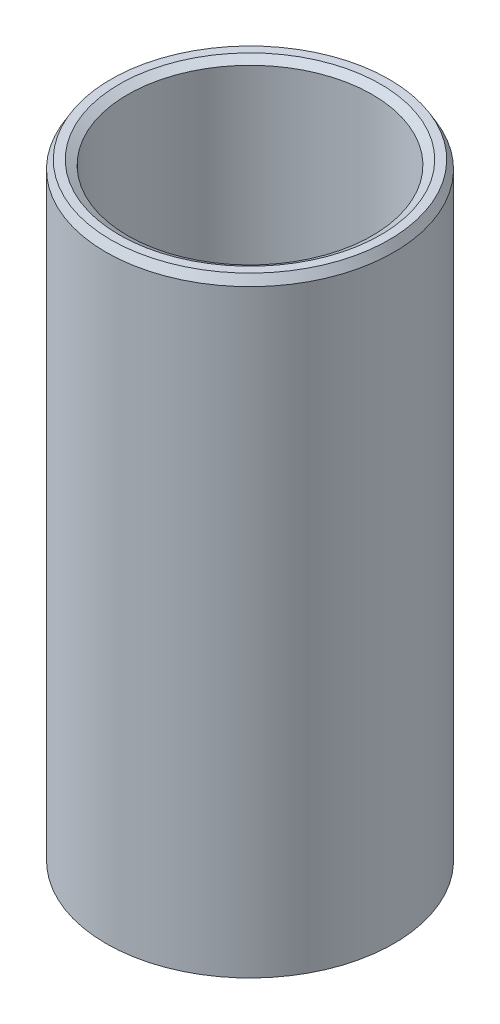
ISO-10303-21;
HEADER;
FILE_DESCRIPTION(('STEP AP214'),'2;1');
FILE_NAME('part.step','',(''),(''),'','','');
FILE_SCHEMA(('AUTOMOTIVE_DESIGN { 1 0 10303 214 1 1 1 1 }'));
ENDSEC;
DATA;
#1=APPLICATION_CONTEXT('core data for automotive mechanical design processes');
#2=APPLICATION_PROTOCOL_DEFINITION('international standard','automotive_design',2000,#1);
#3=PRODUCT_CONTEXT('',#1,'mechanical');
#4=PRODUCT('Part','Part','',(#3));
#5=PRODUCT_RELATED_PRODUCT_CATEGORY('part','',(#4));
#6=PRODUCT_DEFINITION_FORMATION('','',#4);
#7=PRODUCT_DEFINITION_CONTEXT('part definition',#1,'design');
#8=PRODUCT_DEFINITION('design','',#6,#7);
#9=PRODUCT_DEFINITION_SHAPE('','',#8);
#10=(LENGTH_UNIT() NAMED_UNIT(*) SI_UNIT(.MILLI.,.METRE.));
#11=(NAMED_UNIT(*) PLANE_ANGLE_UNIT() SI_UNIT($,.RADIAN.));
#12=(NAMED_UNIT(*) SI_UNIT($,.STERADIAN.) SOLID_ANGLE_UNIT());
#13=UNCERTAINTY_MEASURE_WITH_UNIT(LENGTH_MEASURE(1.E-05),#10,'distance_accuracy_value','');
#14=(GEOMETRIC_REPRESENTATION_CONTEXT(3) GLOBAL_UNCERTAINTY_ASSIGNED_CONTEXT((#13)) GLOBAL_UNIT_ASSIGNED_CONTEXT((#10,
#11,#12)) REPRESENTATION_CONTEXT('',''));
#15=CARTESIAN_POINT('',(0.,0.,0.));
#16=DIRECTION('',(0.,0.,1.));
#17=DIRECTION('',(1.,0.,0.));
#18=AXIS2_PLACEMENT_3D('',#15,#16,#17);
#19=CARTESIAN_POINT('',(0.,233.828254303546,0.));
#20=DIRECTION('',(0.,-1.,0.));
#21=DIRECTION('',(0.,0.,-1.));
#22=AXIS2_PLACEMENT_3D('',#19,#20,#21);
#23=CYLINDRICAL_SURFACE('',#22,55.);
#24=CARTESIAN_POINT('',(0.,1.84201096185144,0.));
#25=DIRECTION('',(0.,1.,0.));
#26=DIRECTION('',(0.,0.,1.));
#27=AXIS2_PLACEMENT_3D('',#24,#25,#26);
#28=CIRCLE('',#27,55.);
#29=CARTESIAN_POINT('',(0.,1.84201096185141,-55.));
#30=VERTEX_POINT('',#29);
#31=EDGE_CURVE('E10',#30,#30,#28,.T.);
#32=CARTESIAN_POINT('',(0.,230.637797729521,0.));
#33=DIRECTION('',(0.,1.,0.));
#34=DIRECTION('',(0.,0.,1.));
#35=AXIS2_PLACEMENT_3D('',#32,#33,#34);
#36=CIRCLE('',#35,55.);
#37=CARTESIAN_POINT('',(0.,230.637797729521,-55.));
#38=VERTEX_POINT('',#37);
#39=EDGE_CURVE('E50',#38,#38,#36,.F.);
#40=CARTESIAN_POINT('',(0.,1.84201096185141,-55.));
#41=CARTESIAN_POINT('',(0.,4.22530040734797,-55.));
#42=CARTESIAN_POINT('',(0.,6.60858985284453,-55.));
#43=CARTESIAN_POINT('',(0.,11.3751687438376,-55.));
#44=CARTESIAN_POINT('',(0.,13.7584581893342,-55.));
#45=CARTESIAN_POINT('',(0.,18.5250370803273,-55.));
#46=CARTESIAN_POINT('',(0.,20.9083265258239,-55.));
#47=CARTESIAN_POINT('',(0.,25.674905416817,-55.));
#48=CARTESIAN_POINT('',(0.,28.0581948623135,-55.));
#49=CARTESIAN_POINT('',(0.,32.8247737533066,-55.));
#50=CARTESIAN_POINT('',(0.,35.2080631988032,-55.));
#51=CARTESIAN_POINT('',(0.,39.9746420897963,-55.));
#52=CARTESIAN_POINT('',(0.,42.3579315352929,-55.));
#53=CARTESIAN_POINT('',(0.,47.124510426286,-55.));
#54=CARTESIAN_POINT('',(0.,49.5077998717825,-55.));
#55=CARTESIAN_POINT('',(0.,54.2743787627756,-55.));
#56=CARTESIAN_POINT('',(0.,56.6576682082722,-55.));
#57=CARTESIAN_POINT('',(0.,61.4242470992653,-55.));
#58=CARTESIAN_POINT('',(0.,63.8075365447619,-55.));
#59=CARTESIAN_POINT('',(0.,68.574115435755,-55.));
#60=CARTESIAN_POINT('',(0.,70.9574048812515,-55.));
#61=CARTESIAN_POINT('',(0.,75.7239837722446,-55.));
#62=CARTESIAN_POINT('',(0.,78.1072732177412,-55.));
#63=CARTESIAN_POINT('',(0.,82.8738521087343,-55.));
#64=CARTESIAN_POINT('',(0.,85.2571415542309,-55.));
#65=CARTESIAN_POINT('',(0.,90.023720445224,-55.));
#66=CARTESIAN_POINT('',(0.,92.4070098907205,-55.));
#67=CARTESIAN_POINT('',(0.,97.1735887817137,-55.));
#68=CARTESIAN_POINT('',(0.,99.5568782272102,-55.));
#69=CARTESIAN_POINT('',(0.,104.323457118203,-55.));
#70=CARTESIAN_POINT('',(0.,106.7067465637,-55.));
#71=CARTESIAN_POINT('',(0.,111.473325454693,-55.));
#72=CARTESIAN_POINT('',(0.,113.85661490019,-55.));
#73=CARTESIAN_POINT('',(0.,118.623193791183,-55.));
#74=CARTESIAN_POINT('',(0.,121.006483236679,-55.));
#75=CARTESIAN_POINT('',(0.,125.773062127672,-55.));
#76=CARTESIAN_POINT('',(0.,128.156351573169,-55.));
#77=CARTESIAN_POINT('',(0.,132.922930464162,-55.));
#78=CARTESIAN_POINT('',(0.,135.306219909659,-55.));
#79=CARTESIAN_POINT('',(0.,140.072798800652,-55.));
#80=CARTESIAN_POINT('',(0.,142.456088246148,-55.));
#81=CARTESIAN_POINT('',(0.,147.222667137141,-55.));
#82=CARTESIAN_POINT('',(0.,149.605956582638,-55.));
#83=CARTESIAN_POINT('',(0.,154.372535473631,-55.));
#84=CARTESIAN_POINT('',(0.,156.755824919128,-55.));
#85=CARTESIAN_POINT('',(0.,161.522403810121,-55.));
#86=CARTESIAN_POINT('',(0.,163.905693255617,-55.));
#87=CARTESIAN_POINT('',(0.,168.67227214661,-55.));
#88=CARTESIAN_POINT('',(0.,171.055561592107,-55.));
#89=CARTESIAN_POINT('',(0.,175.8221404831,-55.));
#90=CARTESIAN_POINT('',(0.,178.205429928597,-55.));
#91=CARTESIAN_POINT('',(0.,182.97200881959,-55.));
#92=CARTESIAN_POINT('',(0.,185.355298265086,-55.));
#93=CARTESIAN_POINT('',(0.,190.121877156079,-55.));
#94=CARTESIAN_POINT('',(0.,192.505166601576,-55.));
#95=CARTESIAN_POINT('',(0.,197.271745492569,-55.));
#96=CARTESIAN_POINT('',(0.,199.655034938066,-55.));
#97=CARTESIAN_POINT('',(0.,204.421613829059,-55.));
#98=CARTESIAN_POINT('',(0.,206.804903274555,-55.));
#99=CARTESIAN_POINT('',(0.,211.571482165548,-55.));
#100=CARTESIAN_POINT('',(0.,213.954771611045,-55.));
#101=CARTESIAN_POINT('',(0.,218.721350502038,-55.));
#102=CARTESIAN_POINT('',(0.,221.104639947535,-55.));
#103=CARTESIAN_POINT('',(0.,225.871218838528,-55.));
#104=CARTESIAN_POINT('',(0.,228.254508284024,-55.));
#105=CARTESIAN_POINT('',(0.,230.637797729521,-55.));
#106=B_SPLINE_CURVE_WITH_KNOTS('',3,(#40,#41,#42,#43,#44,#45,#46,#47,#48,#49,#50,#51,#52,#53,
#54,#55,#56,#57,#58,#59,#60,#61,#62,#63,#64,#65,#66,#67,#68,#69,#70,#71,#72,#73,#74,#75,#76,#77,
#78,#79,#80,#81,#82,#83,#84,#85,#86,#87,#88,#89,#90,#91,#92,#93,#94,#95,#96,#97,#98,#99,#100,
#101,#102,#103,#104,#105),.UNSPECIFIED.,.F.,.F.,(4,2,2,2,2,2,2,2,2,2,2,2,2,2,2,2,2,2,2,2,2,2,2,
2,2,2,2,2,2,2,2,2,4),(0.,7.14986833648967,14.2997366729793,21.449605009469,28.5994733459587,
35.7493416824483,42.899210018938,50.0490783554277,57.1989466919173,64.348815028407,
71.4986833648967,78.6485517013864,85.798420037876,92.9482883743657,100.098156710855,
107.248025047345,114.397893383835,121.547761720324,128.697630056814,135.847498393304,
142.997366729793,150.147235066283,157.297103402773,164.446971739262,171.596840075752,
178.746708412242,185.896576748731,193.046445085221,200.196313421711,207.3461817582,
214.49605009469,221.64591843118,228.795786767669),.UNSPECIFIED.);
#107=EDGE_CURVE('BSEAM39',#30,#38,#106,.T.);
#108=ORIENTED_EDGE('',*,*,#31,.T.);
#109=ORIENTED_EDGE('',*,*,#39,.T.);
#110=ORIENTED_EDGE('',*,*,#107,.T.);
#111=ORIENTED_EDGE('',*,*,#107,.F.);
#112=EDGE_LOOP('',(#108,#110,#109,#111));
#113=FACE_BOUND('',#112,.T.);
#114=ADVANCED_FACE('F39',(#113),#23,.T.);
#115=CARTESIAN_POINT('',(0.,233.828254303546,0.));
#116=DIRECTION('',(0.,1.,0.));
#117=DIRECTION('',(0.,0.,1.));
#118=AXIS2_PLACEMENT_3D('',#115,#116,#117);
#119=PLANE('',#118);
#120=CARTESIAN_POINT('',(0.,233.828254303546,0.));
#121=DIRECTION('',(0.,1.,0.));
#122=DIRECTION('',(0.,0.,1.));
#123=AXIS2_PLACEMENT_3D('',#120,#121,#122);
#124=CIRCLE('',#123,49.9234246095822);
#125=CARTESIAN_POINT('',(0.,233.828254303546,49.9234246095822));
#126=VERTEX_POINT('',#125);
#127=EDGE_CURVE('E58',#126,#126,#124,.F.);
#128=ORIENTED_EDGE('',*,*,#127,.T.);
#129=EDGE_LOOP('',(#128));
#130=FACE_BOUND('',#129,.T.);
#131=CARTESIAN_POINT('',(0.,233.828254303546,0.));
#132=DIRECTION('',(0.,1.,0.));
#133=DIRECTION('',(0.,0.,1.));
#134=AXIS2_PLACEMENT_3D('',#131,#132,#133);
#135=CIRCLE('',#134,53.1579890381487);
#136=CARTESIAN_POINT('',(0.,233.828254303546,53.1579890381487));
#137=VERTEX_POINT('',#136);
#138=EDGE_CURVE('E61',#137,#137,#135,.T.);
#139=ORIENTED_EDGE('',*,*,#138,.T.);
#140=EDGE_LOOP('',(#139));
#141=FACE_BOUND('',#140,.T.);
#142=ADVANCED_FACE('F88',(#130,#141),#119,.T.);
#143=CARTESIAN_POINT('',(0.,0.,0.));
#144=DIRECTION('',(0.,1.,0.));
#145=DIRECTION('',(0.,0.,1.));
#146=AXIS2_PLACEMENT_3D('',#143,#144,#145);
#147=PLANE('',#146);
#148=CARTESIAN_POINT('',(0.,0.,0.));
#149=DIRECTION('',(0.,1.,0.));
#150=DIRECTION('',(0.,0.,1.));
#151=AXIS2_PLACEMENT_3D('',#148,#149,#150);
#152=CIRCLE('',#151,48.5749789974081);
#153=CARTESIAN_POINT('',(0.,0.,48.5749789974081));
#154=VERTEX_POINT('',#153);
#155=EDGE_CURVE('E51',#154,#154,#152,.T.);
#156=ORIENTED_EDGE('',*,*,#155,.T.);
#157=EDGE_LOOP('',(#156));
#158=FACE_BOUND('',#157,.T.);
#159=CARTESIAN_POINT('',(0.,0.,0.));
#160=DIRECTION('',(0.,1.,0.));
#161=DIRECTION('',(0.,0.,1.));
#162=AXIS2_PLACEMENT_3D('',#159,#160,#161);
#163=CIRCLE('',#162,51.8095434259744);
#164=CARTESIAN_POINT('',(0.,0.,51.8095434259744));
#165=VERTEX_POINT('',#164);
#166=EDGE_CURVE('E54',#165,#165,#163,.F.);
#167=ORIENTED_EDGE('',*,*,#166,.T.);
#168=EDGE_LOOP('',(#167));
#169=FACE_BOUND('',#168,.T.);
#170=ADVANCED_FACE('F83',(#158,#169),#147,.F.);
#171=CARTESIAN_POINT('',(0.,233.828254303546,0.));
#172=DIRECTION('',(0.,-1.,0.));
#173=DIRECTION('',(0.,0.,-1.));
#174=AXIS2_PLACEMENT_3D('',#171,#172,#173);
#175=CYLINDRICAL_SURFACE('',#174,46.7329680355567);
#176=CARTESIAN_POINT('',(0.,231.986243341695,0.));
#177=DIRECTION('',(0.,1.,0.));
#178=DIRECTION('',(0.,0.,1.));
#179=AXIS2_PLACEMENT_3D('',#176,#177,#178);
#180=CIRCLE('',#179,46.7329680355567);
#181=CARTESIAN_POINT('',(0.,231.986243341695,-46.7329680355567));
#182=VERTEX_POINT('',#181);
#183=EDGE_CURVE('E67',#182,#182,#180,.T.);
#184=CARTESIAN_POINT('',(0.,3.19045657402545,0.));
#185=DIRECTION('',(0.,1.,0.));
#186=DIRECTION('',(0.,0.,1.));
#187=AXIS2_PLACEMENT_3D('',#184,#185,#186);
#188=CIRCLE('',#187,46.7329680355567);
#189=CARTESIAN_POINT('',(0.,3.19045657402542,-46.7329680355567));
#190=VERTEX_POINT('',#189);
#191=EDGE_CURVE('E69',#190,#190,#188,.F.);
#192=CARTESIAN_POINT('',(0.,231.986243341695,-46.7329680355567));
#193=CARTESIAN_POINT('',(0.,229.602953896198,-46.7329680355567));
#194=CARTESIAN_POINT('',(0.,227.219664450702,-46.7329680355567));
#195=CARTESIAN_POINT('',(0.,222.453085559708,-46.7329680355567));
#196=CARTESIAN_POINT('',(0.,220.069796114212,-46.7329680355567));
#197=CARTESIAN_POINT('',(0.,215.303217223219,-46.7329680355567));
#198=CARTESIAN_POINT('',(0.,212.919927777722,-46.7329680355567));
#199=CARTESIAN_POINT('',(0.,208.153348886729,-46.7329680355567));
#200=CARTESIAN_POINT('',(0.,205.770059441233,-46.7329680355567));
#201=CARTESIAN_POINT('',(0.,201.00348055024,-46.7329680355567));
#202=CARTESIAN_POINT('',(0.,198.620191104743,-46.7329680355567));
#203=CARTESIAN_POINT('',(0.,193.85361221375,-46.7329680355567));
#204=CARTESIAN_POINT('',(0.,191.470322768253,-46.7329680355567));
#205=CARTESIAN_POINT('',(0.,186.70374387726,-46.7329680355567));
#206=CARTESIAN_POINT('',(0.,184.320454431764,-46.7329680355567));
#207=CARTESIAN_POINT('',(0.,179.553875540771,-46.7329680355567));
#208=CARTESIAN_POINT('',(0.,177.170586095274,-46.7329680355567));
#209=CARTESIAN_POINT('',(0.,172.404007204281,-46.7329680355567));
#210=CARTESIAN_POINT('',(0.,170.020717758784,-46.7329680355567));
#211=CARTESIAN_POINT('',(0.,165.254138867791,-46.7329680355567));
#212=CARTESIAN_POINT('',(0.,162.870849422295,-46.7329680355567));
#213=CARTESIAN_POINT('',(0.,158.104270531302,-46.7329680355567));
#214=CARTESIAN_POINT('',(0.,155.720981085805,-46.7329680355567));
#215=CARTESIAN_POINT('',(0.,150.954402194812,-46.7329680355567));
#216=CARTESIAN_POINT('',(0.,148.571112749315,-46.7329680355567));
#217=CARTESIAN_POINT('',(0.,143.804533858322,-46.7329680355567));
#218=CARTESIAN_POINT('',(0.,141.421244412826,-46.7329680355567));
#219=CARTESIAN_POINT('',(0.,136.654665521832,-46.7329680355567));
#220=CARTESIAN_POINT('',(0.,134.271376076336,-46.7329680355567));
#221=CARTESIAN_POINT('',(0.,129.504797185343,-46.7329680355567));
#222=CARTESIAN_POINT('',(0.,127.121507739846,-46.7329680355567));
#223=CARTESIAN_POINT('',(0.,122.354928848853,-46.7329680355567));
#224=CARTESIAN_POINT('',(0.,119.971639403357,-46.7329680355567));
#225=CARTESIAN_POINT('',(0.,115.205060512364,-46.7329680355567));
#226=CARTESIAN_POINT('',(0.,112.821771066867,-46.7329680355567));
#227=CARTESIAN_POINT('',(0.,108.055192175874,-46.7329680355567));
#228=CARTESIAN_POINT('',(0.,105.671902730377,-46.7329680355567));
#229=CARTESIAN_POINT('',(0.,100.905323839384,-46.7329680355567));
#230=CARTESIAN_POINT('',(0.,98.5220343938877,-46.7329680355567));
#231=CARTESIAN_POINT('',(0.,93.7554555028946,-46.7329680355567));
#232=CARTESIAN_POINT('',(0.,91.372166057398,-46.7329680355567));
#233=CARTESIAN_POINT('',(0.,86.6055871664049,-46.7329680355567));
#234=CARTESIAN_POINT('',(0.,84.2222977209083,-46.7329680355567));
#235=CARTESIAN_POINT('',(0.,79.4557188299152,-46.7329680355567));
#236=CARTESIAN_POINT('',(0.,77.0724293844186,-46.7329680355567));
#237=CARTESIAN_POINT('',(0.,72.3058504934255,-46.7329680355567));
#238=CARTESIAN_POINT('',(0.,69.922561047929,-46.7329680355567));
#239=CARTESIAN_POINT('',(0.,65.1559821569359,-46.7329680355567));
#240=CARTESIAN_POINT('',(0.,62.7726927114393,-46.7329680355567));
#241=CARTESIAN_POINT('',(0.,58.0061138204462,-46.7329680355567));
#242=CARTESIAN_POINT('',(0.,55.6228243749496,-46.7329680355567));
#243=CARTESIAN_POINT('',(0.,50.8562454839565,-46.7329680355567));
#244=CARTESIAN_POINT('',(0.,48.47295603846,-46.7329680355567));
#245=CARTESIAN_POINT('',(0.,43.7063771474669,-46.7329680355567));
#246=CARTESIAN_POINT('',(0.,41.3230877019703,-46.7329680355567));
#247=CARTESIAN_POINT('',(0.,36.5565088109772,-46.7329680355567));
#248=CARTESIAN_POINT('',(0.,34.1732193654807,-46.7329680355567));
#249=CARTESIAN_POINT('',(0.,29.4066404744876,-46.7329680355567));
#250=CARTESIAN_POINT('',(0.,27.023351028991,-46.7329680355567));
#251=CARTESIAN_POINT('',(0.,22.2567721379979,-46.7329680355567));
#252=CARTESIAN_POINT('',(0.,19.8734826925013,-46.7329680355567));
#253=CARTESIAN_POINT('',(0.,15.1069038015082,-46.7329680355567));
#254=CARTESIAN_POINT('',(0.,12.7236143560116,-46.7329680355567));
#255=CARTESIAN_POINT('',(0.,7.95703546501854,-46.7329680355567));
#256=CARTESIAN_POINT('',(0.,5.57374601952198,-46.7329680355567));
#257=CARTESIAN_POINT('',(0.,3.19045657402542,-46.7329680355567));
#258=B_SPLINE_CURVE_WITH_KNOTS('',3,(#192,#193,#194,#195,#196,#197,#198,#199,#200,#201,#202,
#203,#204,#205,#206,#207,#208,#209,#210,#211,#212,#213,#214,#215,#216,#217,#218,#219,#220,#221,
#222,#223,#224,#225,#226,#227,#228,#229,#230,#231,#232,#233,#234,#235,#236,#237,#238,#239,#240,
#241,#242,#243,#244,#245,#246,#247,#248,#249,#250,#251,#252,#253,#254,#255,#256,#257),
.UNSPECIFIED.,.F.,.F.,(4,2,2,2,2,2,2,2,2,2,2,2,2,2,2,2,2,2,2,2,2,2,2,2,2,2,2,2,2,2,2,2,4),(0.,
7.14986833648967,14.2997366729793,21.449605009469,28.5994733459587,35.7493416824483,
42.899210018938,50.0490783554277,57.1989466919173,64.348815028407,71.4986833648966,
78.6485517013863,85.798420037876,92.9482883743657,100.098156710855,107.248025047345,
114.397893383835,121.547761720324,128.697630056814,135.847498393304,142.997366729793,
150.147235066283,157.297103402773,164.446971739262,171.596840075752,178.746708412242,
185.896576748731,193.046445085221,200.196313421711,207.3461817582,214.49605009469,
221.64591843118,228.795786767669),.UNSPECIFIED.);
#259=EDGE_CURVE('BSEAM71',#182,#190,#258,.T.);
#260=ORIENTED_EDGE('',*,*,#183,.T.);
#261=ORIENTED_EDGE('',*,*,#191,.T.);
#262=ORIENTED_EDGE('',*,*,#259,.T.);
#263=ORIENTED_EDGE('',*,*,#259,.F.);
#264=EDGE_LOOP('',(#260,#262,#261,#263));
#265=FACE_BOUND('',#264,.T.);
#266=ADVANCED_FACE('F71',(#265),#175,.F.);
#267=CARTESIAN_POINT('',(0.,231.986243341695,0.));
#268=DIRECTION('',(0.,1.,0.));
#269=DIRECTION('',(0.,0.,1.));
#270=AXIS2_PLACEMENT_3D('',#267,#268,#269);
#271=CONICAL_SURFACE('',#270,46.7329680355567,1.0471975511966);
#272=ORIENTED_EDGE('',*,*,#127,.F.);
#273=EDGE_LOOP('',(#272));
#274=FACE_BOUND('',#273,.T.);
#275=ORIENTED_EDGE('',*,*,#183,.F.);
#276=EDGE_LOOP('',(#275));
#277=FACE_BOUND('',#276,.T.);
#278=ADVANCED_FACE('F77',(#274,#277),#271,.F.);
#279=CARTESIAN_POINT('',(0.,0.,0.));
#280=DIRECTION('',(0.,-1.,0.));
#281=DIRECTION('',(0.,0.,-1.));
#282=AXIS2_PLACEMENT_3D('',#279,#280,#281);
#283=CONICAL_SURFACE('',#282,48.5749789974081,0.523598775598297);
#284=ORIENTED_EDGE('',*,*,#191,.F.);
#285=EDGE_LOOP('',(#284));
#286=FACE_BOUND('',#285,.T.);
#287=ORIENTED_EDGE('',*,*,#155,.F.);
#288=EDGE_LOOP('',(#287));
#289=FACE_BOUND('',#288,.T.);
#290=ADVANCED_FACE('F73',(#286,#289),#283,.F.);
#291=CARTESIAN_POINT('',(0.,1.84201096185144,0.));
#292=DIRECTION('',(0.,1.,0.));
#293=DIRECTION('',(0.,0.,1.));
#294=AXIS2_PLACEMENT_3D('',#291,#292,#293);
#295=CONICAL_SURFACE('',#294,55.,1.04719755119661);
#296=ORIENTED_EDGE('',*,*,#166,.F.);
#297=EDGE_LOOP('',(#296));
#298=FACE_BOUND('',#297,.T.);
#299=ORIENTED_EDGE('',*,*,#31,.F.);
#300=EDGE_LOOP('',(#299));
#301=FACE_BOUND('',#300,.T.);
#302=ADVANCED_FACE('F76',(#298,#301),#295,.T.);
#303=CARTESIAN_POINT('',(0.,233.828254303546,0.));
#304=DIRECTION('',(0.,-1.,0.));
#305=DIRECTION('',(0.,0.,-1.));
#306=AXIS2_PLACEMENT_3D('',#303,#304,#305);
#307=CONICAL_SURFACE('',#306,53.1579890381487,0.523598775598289);
#308=ORIENTED_EDGE('',*,*,#39,.F.);
#309=EDGE_LOOP('',(#308));
#310=FACE_BOUND('',#309,.T.);
#311=ORIENTED_EDGE('',*,*,#138,.F.);
#312=EDGE_LOOP('',(#311));
#313=FACE_BOUND('',#312,.T.);
#314=ADVANCED_FACE('F45',(#310,#313),#307,.T.);
#315=CLOSED_SHELL('',(#114,#142,#170,#266,#278,#290,#302,#314));
#316=MANIFOLD_SOLID_BREP('B2',#315);
#317=ADVANCED_BREP_SHAPE_REPRESENTATION('',(#18,#316),#14);
#318=SHAPE_DEFINITION_REPRESENTATION(#9,#317);
ENDSEC;
END-ISO-10303-21;
